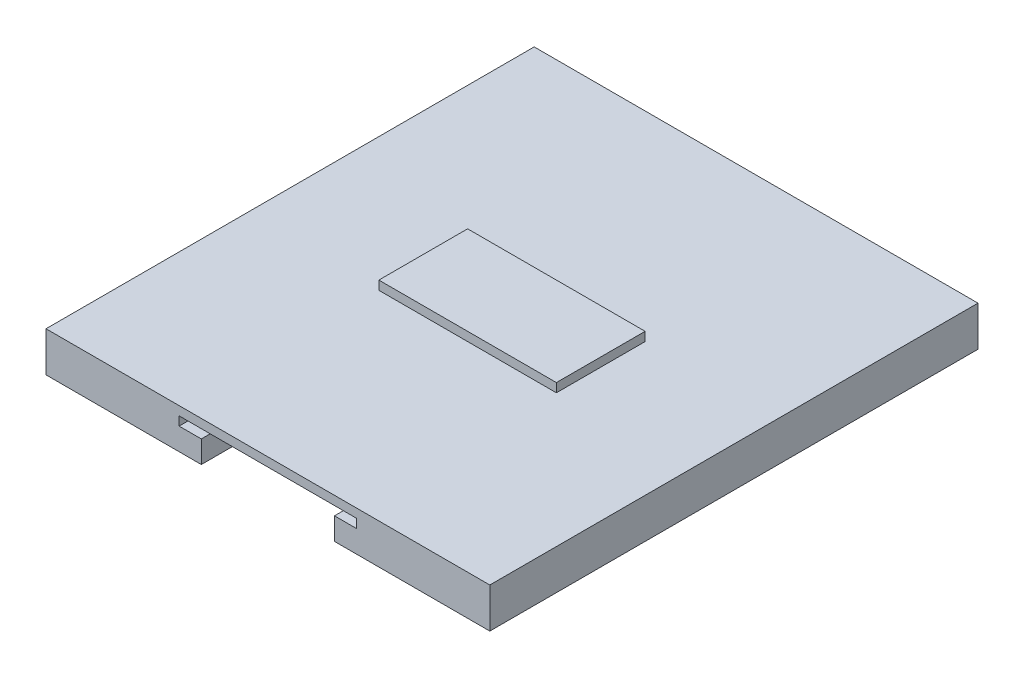
ISO-10303-21;
HEADER;
FILE_DESCRIPTION(('STEP AP214'),'2;1');
FILE_NAME('part.step','',(''),(''),'','','');
FILE_SCHEMA(('AUTOMOTIVE_DESIGN { 1 0 10303 214 1 1 1 1 }'));
ENDSEC;
DATA;
#1=APPLICATION_CONTEXT('core data for automotive mechanical design processes');
#2=APPLICATION_PROTOCOL_DEFINITION('international standard','automotive_design',2000,#1);
#3=PRODUCT_CONTEXT('',#1,'mechanical');
#4=PRODUCT('Part','Part','',(#3));
#5=PRODUCT_RELATED_PRODUCT_CATEGORY('part','',(#4));
#6=PRODUCT_DEFINITION_FORMATION('','',#4);
#7=PRODUCT_DEFINITION_CONTEXT('part definition',#1,'design');
#8=PRODUCT_DEFINITION('design','',#6,#7);
#9=PRODUCT_DEFINITION_SHAPE('','',#8);
#10=(LENGTH_UNIT() NAMED_UNIT(*) SI_UNIT(.MILLI.,.METRE.));
#11=(NAMED_UNIT(*) PLANE_ANGLE_UNIT() SI_UNIT($,.RADIAN.));
#12=(NAMED_UNIT(*) SI_UNIT($,.STERADIAN.) SOLID_ANGLE_UNIT());
#13=UNCERTAINTY_MEASURE_WITH_UNIT(LENGTH_MEASURE(1.E-05),#10,'distance_accuracy_value','');
#14=(GEOMETRIC_REPRESENTATION_CONTEXT(3) GLOBAL_UNCERTAINTY_ASSIGNED_CONTEXT((#13)) GLOBAL_UNIT_ASSIGNED_CONTEXT((#10,
#11,#12)) REPRESENTATION_CONTEXT('',''));
#15=CARTESIAN_POINT('',(0.,0.,0.));
#16=DIRECTION('',(0.,0.,1.));
#17=DIRECTION('',(1.,0.,0.));
#18=AXIS2_PLACEMENT_3D('',#15,#16,#17);
#19=CARTESIAN_POINT('',(-50.,8.99999999999999,55.));
#20=DIRECTION('',(0.,1.,0.));
#21=DIRECTION('',(0.,0.,1.));
#22=AXIS2_PLACEMENT_3D('',#19,#20,#21);
#23=PLANE('',#22);
#24=DIRECTION('',(1.,0.,0.));
#25=VECTOR('',#24,1.);
#26=CARTESIAN_POINT('',(-50.,8.99999999999999,-55.));
#27=LINE('',#26,#25);
#28=CARTESIAN_POINT('',(-50.,8.99999999999999,-55.));
#29=VERTEX_POINT('',#28);
#30=CARTESIAN_POINT('',(50.,8.99999999999999,-55.));
#31=VERTEX_POINT('',#30);
#32=EDGE_CURVE('E259',#29,#31,#27,.T.);
#33=ORIENTED_EDGE('',*,*,#32,.F.);
#34=DIRECTION('',(0.,0.,-1.));
#35=VECTOR('',#34,1.);
#36=CARTESIAN_POINT('',(-50.,8.99999999999999,55.));
#37=LINE('',#36,#35);
#38=CARTESIAN_POINT('',(-50.,8.99999999999999,55.));
#39=VERTEX_POINT('',#38);
#40=EDGE_CURVE('E46',#39,#29,#37,.T.);
#41=ORIENTED_EDGE('',*,*,#40,.F.);
#42=DIRECTION('',(1.,0.,0.));
#43=VECTOR('',#42,1.);
#44=CARTESIAN_POINT('',(-50.,8.99999999999999,55.));
#45=LINE('',#44,#43);
#46=CARTESIAN_POINT('',(50.,8.99999999999999,55.));
#47=VERTEX_POINT('',#46);
#48=EDGE_CURVE('E246',#39,#47,#45,.T.);
#49=ORIENTED_EDGE('',*,*,#48,.T.);
#50=DIRECTION('',(0.,0.,-1.));
#51=VECTOR('',#50,1.);
#52=CARTESIAN_POINT('',(50.,8.99999999999999,55.));
#53=LINE('',#52,#51);
#54=EDGE_CURVE('E268',#47,#31,#53,.T.);
#55=ORIENTED_EDGE('',*,*,#54,.T.);
#56=EDGE_LOOP('',(#33,#41,#49,#55));
#57=FACE_BOUND('',#56,.T.);
#58=DIRECTION('',(1.,0.,0.));
#59=VECTOR('',#58,1.);
#60=CARTESIAN_POINT('',(-20.,8.99999999999999,10.));
#61=LINE('',#60,#59);
#62=CARTESIAN_POINT('',(-20.,8.99999999999999,10.));
#63=VERTEX_POINT('',#62);
#64=CARTESIAN_POINT('',(20.,8.99999999999999,10.));
#65=VERTEX_POINT('',#64);
#66=EDGE_CURVE('E561',#63,#65,#61,.T.);
#67=ORIENTED_EDGE('',*,*,#66,.F.);
#68=DIRECTION('',(0.,0.,1.));
#69=VECTOR('',#68,1.);
#70=CARTESIAN_POINT('',(-20.,8.99999999999999,-10.));
#71=LINE('',#70,#69);
#72=CARTESIAN_POINT('',(-20.,8.99999999999999,-10.));
#73=VERTEX_POINT('',#72);
#74=EDGE_CURVE('E180',#73,#63,#71,.T.);
#75=ORIENTED_EDGE('',*,*,#74,.F.);
#76=DIRECTION('',(-1.,0.,0.));
#77=VECTOR('',#76,1.);
#78=CARTESIAN_POINT('',(-20.,8.99999999999999,-10.));
#79=LINE('',#78,#77);
#80=CARTESIAN_POINT('',(20.,8.99999999999999,-10.));
#81=VERTEX_POINT('',#80);
#82=EDGE_CURVE('E176',#81,#73,#79,.T.);
#83=ORIENTED_EDGE('',*,*,#82,.F.);
#84=DIRECTION('',(0.,0.,-1.));
#85=VECTOR('',#84,1.);
#86=CARTESIAN_POINT('',(20.,8.99999999999999,-10.));
#87=LINE('',#86,#85);
#88=EDGE_CURVE('E558',#65,#81,#87,.T.);
#89=ORIENTED_EDGE('',*,*,#88,.F.);
#90=EDGE_LOOP('',(#67,#75,#83,#89));
#91=FACE_BOUND('',#90,.T.);
#92=ADVANCED_FACE('F42',(#57,#91),#23,.T.);
#93=CARTESIAN_POINT('',(-50.,0.,55.));
#94=DIRECTION('',(0.,-1.,0.));
#95=DIRECTION('',(0.,0.,-1.));
#96=AXIS2_PLACEMENT_3D('',#93,#94,#95);
#97=PLANE('',#96);
#98=DIRECTION('',(0.,0.,-1.));
#99=VECTOR('',#98,1.);
#100=CARTESIAN_POINT('',(-15.,0.,55.));
#101=LINE('',#100,#99);
#102=CARTESIAN_POINT('',(-15.,0.,55.));
#103=VERTEX_POINT('',#102);
#104=CARTESIAN_POINT('',(-15.,0.,-55.));
#105=VERTEX_POINT('',#104);
#106=EDGE_CURVE('E229',#103,#105,#101,.T.);
#107=ORIENTED_EDGE('',*,*,#106,.F.);
#108=DIRECTION('',(-1.,0.,0.));
#109=VECTOR('',#108,1.);
#110=CARTESIAN_POINT('',(-50.,0.,55.));
#111=LINE('',#110,#109);
#112=CARTESIAN_POINT('',(-50.,0.,55.));
#113=VERTEX_POINT('',#112);
#114=EDGE_CURVE('E253',#103,#113,#111,.T.);
#115=ORIENTED_EDGE('',*,*,#114,.T.);
#116=DIRECTION('',(0.,0.,-1.));
#117=VECTOR('',#116,1.);
#118=CARTESIAN_POINT('',(-50.,0.,55.));
#119=LINE('',#118,#117);
#120=CARTESIAN_POINT('',(-50.,0.,-55.));
#121=VERTEX_POINT('',#120);
#122=EDGE_CURVE('E11',#113,#121,#119,.T.);
#123=ORIENTED_EDGE('',*,*,#122,.T.);
#124=DIRECTION('',(-1.,0.,0.));
#125=VECTOR('',#124,1.);
#126=CARTESIAN_POINT('',(-50.,0.,-55.));
#127=LINE('',#126,#125);
#128=EDGE_CURVE('E265',#105,#121,#127,.T.);
#129=ORIENTED_EDGE('',*,*,#128,.F.);
#130=EDGE_LOOP('',(#107,#115,#123,#129));
#131=FACE_BOUND('',#130,.T.);
#132=ADVANCED_FACE('F284',(#131),#97,.T.);
#133=CARTESIAN_POINT('',(-50.,8.99999999999999,55.));
#134=DIRECTION('',(-1.,0.,0.));
#135=DIRECTION('',(0.,0.,1.));
#136=AXIS2_PLACEMENT_3D('',#133,#134,#135);
#137=PLANE('',#136);
#138=DIRECTION('',(0.,1.,0.));
#139=VECTOR('',#138,1.);
#140=CARTESIAN_POINT('',(-50.,8.99999999999999,-55.));
#141=LINE('',#140,#139);
#142=EDGE_CURVE('E228',#121,#29,#141,.T.);
#143=ORIENTED_EDGE('',*,*,#142,.F.);
#144=ORIENTED_EDGE('',*,*,#122,.F.);
#145=DIRECTION('',(0.,1.,0.));
#146=VECTOR('',#145,1.);
#147=CARTESIAN_POINT('',(-50.,8.99999999999999,55.));
#148=LINE('',#147,#146);
#149=EDGE_CURVE('E243',#113,#39,#148,.T.);
#150=ORIENTED_EDGE('',*,*,#149,.T.);
#151=ORIENTED_EDGE('',*,*,#40,.T.);
#152=EDGE_LOOP('',(#143,#144,#150,#151));
#153=FACE_BOUND('',#152,.T.);
#154=ADVANCED_FACE('F44',(#153),#137,.T.);
#155=DIRECTION('',(0.,0.,-1.));
#156=VECTOR('',#155,1.);
#157=CARTESIAN_POINT('',(15.,0.,55.));
#158=LINE('',#157,#156);
#159=CARTESIAN_POINT('',(15.,0.,55.));
#160=VERTEX_POINT('',#159);
#161=CARTESIAN_POINT('',(15.,0.,-55.));
#162=VERTEX_POINT('',#161);
#163=EDGE_CURVE('E231',#160,#162,#158,.T.);
#164=ORIENTED_EDGE('',*,*,#163,.T.);
#165=CARTESIAN_POINT('',(50.,0.,-55.));
#166=VERTEX_POINT('',#165);
#167=EDGE_CURVE('E247',#166,#162,#127,.T.);
#168=ORIENTED_EDGE('',*,*,#167,.F.);
#169=DIRECTION('',(0.,0.,-1.));
#170=VECTOR('',#169,1.);
#171=CARTESIAN_POINT('',(50.,0.,55.));
#172=LINE('',#171,#170);
#173=CARTESIAN_POINT('',(50.,0.,55.));
#174=VERTEX_POINT('',#173);
#175=EDGE_CURVE('E51',#174,#166,#172,.T.);
#176=ORIENTED_EDGE('',*,*,#175,.F.);
#177=EDGE_CURVE('E254',#174,#160,#111,.T.);
#178=ORIENTED_EDGE('',*,*,#177,.T.);
#179=EDGE_LOOP('',(#164,#168,#176,#178));
#180=FACE_BOUND('',#179,.T.);
#181=ADVANCED_FACE('F295',(#180),#97,.T.);
#182=CARTESIAN_POINT('',(50.,8.99999999999999,55.));
#183=DIRECTION('',(1.,0.,0.));
#184=DIRECTION('',(0.,0.,-1.));
#185=AXIS2_PLACEMENT_3D('',#182,#183,#184);
#186=PLANE('',#185);
#187=DIRECTION('',(0.,-1.,0.));
#188=VECTOR('',#187,1.);
#189=CARTESIAN_POINT('',(50.,8.99999999999999,-55.));
#190=LINE('',#189,#188);
#191=EDGE_CURVE('E262',#31,#166,#190,.T.);
#192=ORIENTED_EDGE('',*,*,#191,.F.);
#193=ORIENTED_EDGE('',*,*,#54,.F.);
#194=DIRECTION('',(0.,-1.,0.));
#195=VECTOR('',#194,1.);
#196=CARTESIAN_POINT('',(50.,8.99999999999999,55.));
#197=LINE('',#196,#195);
#198=EDGE_CURVE('E250',#47,#174,#197,.T.);
#199=ORIENTED_EDGE('',*,*,#198,.T.);
#200=ORIENTED_EDGE('',*,*,#175,.T.);
#201=EDGE_LOOP('',(#192,#193,#199,#200));
#202=FACE_BOUND('',#201,.T.);
#203=ADVANCED_FACE('F291',(#202),#186,.T.);
#204=CARTESIAN_POINT('',(-50.,0.,55.));
#205=DIRECTION('',(0.,0.,1.));
#206=DIRECTION('',(1.,0.,0.));
#207=AXIS2_PLACEMENT_3D('',#204,#205,#206);
#208=PLANE('',#207);
#209=DIRECTION('',(0.,1.,0.));
#210=VECTOR('',#209,1.);
#211=CARTESIAN_POINT('',(-15.,0.,55.));
#212=LINE('',#211,#210);
#213=CARTESIAN_POINT('',(-15.,5.,55.));
#214=VERTEX_POINT('',#213);
#215=EDGE_CURVE('E207',#103,#214,#212,.T.);
#216=ORIENTED_EDGE('',*,*,#215,.T.);
#217=DIRECTION('',(-1.,0.,0.));
#218=VECTOR('',#217,1.);
#219=CARTESIAN_POINT('',(-15.,5.,55.));
#220=LINE('',#219,#218);
#221=CARTESIAN_POINT('',(-20.,5.,55.));
#222=VERTEX_POINT('',#221);
#223=EDGE_CURVE('E188',#214,#222,#220,.T.);
#224=ORIENTED_EDGE('',*,*,#223,.T.);
#225=DIRECTION('',(0.,1.,0.));
#226=VECTOR('',#225,1.);
#227=CARTESIAN_POINT('',(-20.,5.,55.));
#228=LINE('',#227,#226);
#229=CARTESIAN_POINT('',(-20.,7.,55.));
#230=VERTEX_POINT('',#229);
#231=EDGE_CURVE('E191',#222,#230,#228,.T.);
#232=ORIENTED_EDGE('',*,*,#231,.T.);
#233=DIRECTION('',(1.,0.,0.));
#234=VECTOR('',#233,1.);
#235=CARTESIAN_POINT('',(-20.,7.,55.));
#236=LINE('',#235,#234);
#237=CARTESIAN_POINT('',(20.,7.,55.));
#238=VERTEX_POINT('',#237);
#239=EDGE_CURVE('E195',#230,#238,#236,.T.);
#240=ORIENTED_EDGE('',*,*,#239,.T.);
#241=DIRECTION('',(0.,-1.,0.));
#242=VECTOR('',#241,1.);
#243=CARTESIAN_POINT('',(20.,7.,55.));
#244=LINE('',#243,#242);
#245=CARTESIAN_POINT('',(20.,5.,55.));
#246=VERTEX_POINT('',#245);
#247=EDGE_CURVE('E198',#238,#246,#244,.T.);
#248=ORIENTED_EDGE('',*,*,#247,.T.);
#249=DIRECTION('',(-1.,0.,0.));
#250=VECTOR('',#249,1.);
#251=CARTESIAN_POINT('',(20.,5.,55.));
#252=LINE('',#251,#250);
#253=CARTESIAN_POINT('',(15.,5.,55.));
#254=VERTEX_POINT('',#253);
#255=EDGE_CURVE('E201',#246,#254,#252,.T.);
#256=ORIENTED_EDGE('',*,*,#255,.T.);
#257=DIRECTION('',(0.,-1.,0.));
#258=VECTOR('',#257,1.);
#259=CARTESIAN_POINT('',(15.,5.,55.));
#260=LINE('',#259,#258);
#261=EDGE_CURVE('E204',#254,#160,#260,.T.);
#262=ORIENTED_EDGE('',*,*,#261,.T.);
#263=ORIENTED_EDGE('',*,*,#177,.F.);
#264=ORIENTED_EDGE('',*,*,#198,.F.);
#265=ORIENTED_EDGE('',*,*,#48,.F.);
#266=ORIENTED_EDGE('',*,*,#149,.F.);
#267=ORIENTED_EDGE('',*,*,#114,.F.);
#268=EDGE_LOOP('',(#216,#224,#232,#240,#248,#256,#262,#263,#264,#265,#266,#267));
#269=FACE_BOUND('',#268,.T.);
#270=ADVANCED_FACE('F287',(#269),#208,.T.);
#271=CARTESIAN_POINT('',(-50.,0.,-55.));
#272=DIRECTION('',(0.,0.,1.));
#273=DIRECTION('',(1.,0.,0.));
#274=AXIS2_PLACEMENT_3D('',#271,#272,#273);
#275=PLANE('',#274);
#276=DIRECTION('',(-1.,0.,0.));
#277=VECTOR('',#276,1.);
#278=CARTESIAN_POINT('',(-15.,5.,-55.));
#279=LINE('',#278,#277);
#280=CARTESIAN_POINT('',(-15.,5.,-55.));
#281=VERTEX_POINT('',#280);
#282=CARTESIAN_POINT('',(-20.,5.,-55.));
#283=VERTEX_POINT('',#282);
#284=EDGE_CURVE('E67',#281,#283,#279,.T.);
#285=ORIENTED_EDGE('',*,*,#284,.F.);
#286=DIRECTION('',(0.,1.,0.));
#287=VECTOR('',#286,1.);
#288=CARTESIAN_POINT('',(-15.,0.,-55.));
#289=LINE('',#288,#287);
#290=EDGE_CURVE('E192',#105,#281,#289,.T.);
#291=ORIENTED_EDGE('',*,*,#290,.F.);
#292=ORIENTED_EDGE('',*,*,#128,.T.);
#293=ORIENTED_EDGE('',*,*,#142,.T.);
#294=ORIENTED_EDGE('',*,*,#32,.T.);
#295=ORIENTED_EDGE('',*,*,#191,.T.);
#296=ORIENTED_EDGE('',*,*,#167,.T.);
#297=DIRECTION('',(0.,-1.,0.));
#298=VECTOR('',#297,1.);
#299=CARTESIAN_POINT('',(15.,5.,-55.));
#300=LINE('',#299,#298);
#301=CARTESIAN_POINT('',(15.,5.,-55.));
#302=VERTEX_POINT('',#301);
#303=EDGE_CURVE('E222',#302,#162,#300,.T.);
#304=ORIENTED_EDGE('',*,*,#303,.F.);
#305=DIRECTION('',(-1.,0.,0.));
#306=VECTOR('',#305,1.);
#307=CARTESIAN_POINT('',(20.,5.,-55.));
#308=LINE('',#307,#306);
#309=CARTESIAN_POINT('',(20.,5.,-55.));
#310=VERTEX_POINT('',#309);
#311=EDGE_CURVE('E219',#310,#302,#308,.T.);
#312=ORIENTED_EDGE('',*,*,#311,.F.);
#313=DIRECTION('',(0.,-1.,0.));
#314=VECTOR('',#313,1.);
#315=CARTESIAN_POINT('',(20.,7.,-55.));
#316=LINE('',#315,#314);
#317=CARTESIAN_POINT('',(20.,7.,-55.));
#318=VERTEX_POINT('',#317);
#319=EDGE_CURVE('E216',#318,#310,#316,.T.);
#320=ORIENTED_EDGE('',*,*,#319,.F.);
#321=DIRECTION('',(1.,0.,0.));
#322=VECTOR('',#321,1.);
#323=CARTESIAN_POINT('',(-20.,7.,-55.));
#324=LINE('',#323,#322);
#325=CARTESIAN_POINT('',(-20.,7.,-55.));
#326=VERTEX_POINT('',#325);
#327=EDGE_CURVE('E213',#326,#318,#324,.T.);
#328=ORIENTED_EDGE('',*,*,#327,.F.);
#329=DIRECTION('',(0.,1.,0.));
#330=VECTOR('',#329,1.);
#331=CARTESIAN_POINT('',(-20.,5.,-55.));
#332=LINE('',#331,#330);
#333=EDGE_CURVE('E183',#283,#326,#332,.T.);
#334=ORIENTED_EDGE('',*,*,#333,.F.);
#335=EDGE_LOOP('',(#285,#291,#292,#293,#294,#295,#296,#304,#312,#320,#328,#334));
#336=FACE_BOUND('',#335,.T.);
#337=ADVANCED_FACE('F279',(#336),#275,.F.);
#338=CARTESIAN_POINT('',(-15.,5.,55.));
#339=DIRECTION('',(0.,-1.,0.));
#340=DIRECTION('',(1.,0.,0.));
#341=AXIS2_PLACEMENT_3D('',#338,#339,#340);
#342=PLANE('',#341);
#343=ORIENTED_EDGE('',*,*,#284,.T.);
#344=DIRECTION('',(0.,0.,-1.));
#345=VECTOR('',#344,1.);
#346=CARTESIAN_POINT('',(-20.,5.,55.));
#347=LINE('',#346,#345);
#348=EDGE_CURVE('E209',#222,#283,#347,.T.);
#349=ORIENTED_EDGE('',*,*,#348,.F.);
#350=ORIENTED_EDGE('',*,*,#223,.F.);
#351=DIRECTION('',(0.,0.,-1.));
#352=VECTOR('',#351,1.);
#353=CARTESIAN_POINT('',(-15.,5.,55.));
#354=LINE('',#353,#352);
#355=EDGE_CURVE('E226',#214,#281,#354,.T.);
#356=ORIENTED_EDGE('',*,*,#355,.T.);
#357=EDGE_LOOP('',(#343,#349,#350,#356));
#358=FACE_BOUND('',#357,.T.);
#359=ADVANCED_FACE('F316',(#358),#342,.F.);
#360=CARTESIAN_POINT('',(-15.,0.,55.));
#361=DIRECTION('',(-1.,0.,0.));
#362=DIRECTION('',(0.,-1.,0.));
#363=AXIS2_PLACEMENT_3D('',#360,#361,#362);
#364=PLANE('',#363);
#365=ORIENTED_EDGE('',*,*,#290,.T.);
#366=ORIENTED_EDGE('',*,*,#355,.F.);
#367=ORIENTED_EDGE('',*,*,#215,.F.);
#368=ORIENTED_EDGE('',*,*,#106,.T.);
#369=EDGE_LOOP('',(#365,#366,#367,#368));
#370=FACE_BOUND('',#369,.T.);
#371=ADVANCED_FACE('F318',(#370),#364,.F.);
#372=CARTESIAN_POINT('',(15.,5.,55.));
#373=DIRECTION('',(1.,0.,0.));
#374=DIRECTION('',(0.,1.,0.));
#375=AXIS2_PLACEMENT_3D('',#372,#373,#374);
#376=PLANE('',#375);
#377=ORIENTED_EDGE('',*,*,#303,.T.);
#378=ORIENTED_EDGE('',*,*,#163,.F.);
#379=ORIENTED_EDGE('',*,*,#261,.F.);
#380=DIRECTION('',(0.,0.,-1.));
#381=VECTOR('',#380,1.);
#382=CARTESIAN_POINT('',(15.,5.,55.));
#383=LINE('',#382,#381);
#384=EDGE_CURVE('E234',#254,#302,#383,.T.);
#385=ORIENTED_EDGE('',*,*,#384,.T.);
#386=EDGE_LOOP('',(#377,#378,#379,#385));
#387=FACE_BOUND('',#386,.T.);
#388=ADVANCED_FACE('F298',(#387),#376,.F.);
#389=CARTESIAN_POINT('',(20.,5.,55.));
#390=DIRECTION('',(0.,-1.,0.));
#391=DIRECTION('',(1.,0.,0.));
#392=AXIS2_PLACEMENT_3D('',#389,#390,#391);
#393=PLANE('',#392);
#394=ORIENTED_EDGE('',*,*,#311,.T.);
#395=ORIENTED_EDGE('',*,*,#384,.F.);
#396=ORIENTED_EDGE('',*,*,#255,.F.);
#397=DIRECTION('',(0.,0.,-1.));
#398=VECTOR('',#397,1.);
#399=CARTESIAN_POINT('',(20.,5.,55.));
#400=LINE('',#399,#398);
#401=EDGE_CURVE('E236',#246,#310,#400,.T.);
#402=ORIENTED_EDGE('',*,*,#401,.T.);
#403=EDGE_LOOP('',(#394,#395,#396,#402));
#404=FACE_BOUND('',#403,.T.);
#405=ADVANCED_FACE('F302',(#404),#393,.F.);
#406=CARTESIAN_POINT('',(20.,7.,55.));
#407=DIRECTION('',(1.,0.,0.));
#408=DIRECTION('',(0.,1.,0.));
#409=AXIS2_PLACEMENT_3D('',#406,#407,#408);
#410=PLANE('',#409);
#411=ORIENTED_EDGE('',*,*,#319,.T.);
#412=ORIENTED_EDGE('',*,*,#401,.F.);
#413=ORIENTED_EDGE('',*,*,#247,.F.);
#414=DIRECTION('',(0.,0.,-1.));
#415=VECTOR('',#414,1.);
#416=CARTESIAN_POINT('',(20.,7.,55.));
#417=LINE('',#416,#415);
#418=EDGE_CURVE('E238',#238,#318,#417,.T.);
#419=ORIENTED_EDGE('',*,*,#418,.T.);
#420=EDGE_LOOP('',(#411,#412,#413,#419));
#421=FACE_BOUND('',#420,.T.);
#422=ADVANCED_FACE('F308',(#421),#410,.F.);
#423=CARTESIAN_POINT('',(-20.,7.,55.));
#424=DIRECTION('',(0.,1.,0.));
#425=DIRECTION('',(0.,0.,1.));
#426=AXIS2_PLACEMENT_3D('',#423,#424,#425);
#427=PLANE('',#426);
#428=ORIENTED_EDGE('',*,*,#327,.T.);
#429=ORIENTED_EDGE('',*,*,#418,.F.);
#430=ORIENTED_EDGE('',*,*,#239,.F.);
#431=DIRECTION('',(0.,0.,-1.));
#432=VECTOR('',#431,1.);
#433=CARTESIAN_POINT('',(-20.,7.,55.));
#434=LINE('',#433,#432);
#435=EDGE_CURVE('E240',#230,#326,#434,.T.);
#436=ORIENTED_EDGE('',*,*,#435,.T.);
#437=EDGE_LOOP('',(#428,#429,#430,#436));
#438=FACE_BOUND('',#437,.T.);
#439=ADVANCED_FACE('F311',(#438),#427,.F.);
#440=CARTESIAN_POINT('',(-20.,5.,55.));
#441=DIRECTION('',(-1.,0.,0.));
#442=DIRECTION('',(0.,0.,1.));
#443=AXIS2_PLACEMENT_3D('',#440,#441,#442);
#444=PLANE('',#443);
#445=ORIENTED_EDGE('',*,*,#333,.T.);
#446=ORIENTED_EDGE('',*,*,#435,.F.);
#447=ORIENTED_EDGE('',*,*,#231,.F.);
#448=ORIENTED_EDGE('',*,*,#348,.T.);
#449=EDGE_LOOP('',(#445,#446,#447,#448));
#450=FACE_BOUND('',#449,.T.);
#451=ADVANCED_FACE('F314',(#450),#444,.F.);
#452=CARTESIAN_POINT('',(-20.,11.,-10.));
#453=DIRECTION('',(1.,0.,0.));
#454=DIRECTION('',(0.,0.,-1.));
#455=AXIS2_PLACEMENT_3D('',#452,#453,#454);
#456=PLANE('',#455);
#457=ORIENTED_EDGE('',*,*,#74,.T.);
#458=DIRECTION('',(0.,-1.,0.));
#459=VECTOR('',#458,1.);
#460=CARTESIAN_POINT('',(-20.,11.,10.));
#461=LINE('',#460,#459);
#462=CARTESIAN_POINT('',(-20.,11.,10.));
#463=VERTEX_POINT('',#462);
#464=EDGE_CURVE('E161',#463,#63,#461,.T.);
#465=ORIENTED_EDGE('',*,*,#464,.F.);
#466=DIRECTION('',(0.,0.,1.));
#467=VECTOR('',#466,1.);
#468=CARTESIAN_POINT('',(-20.,11.,-10.));
#469=LINE('',#468,#467);
#470=CARTESIAN_POINT('',(-20.,11.,-10.));
#471=VERTEX_POINT('',#470);
#472=EDGE_CURVE('E168',#471,#463,#469,.T.);
#473=ORIENTED_EDGE('',*,*,#472,.F.);
#474=DIRECTION('',(0.,-1.,0.));
#475=VECTOR('',#474,1.);
#476=CARTESIAN_POINT('',(-20.,11.,-10.));
#477=LINE('',#476,#475);
#478=EDGE_CURVE('E556',#471,#73,#477,.T.);
#479=ORIENTED_EDGE('',*,*,#478,.T.);
#480=EDGE_LOOP('',(#457,#465,#473,#479));
#481=FACE_BOUND('',#480,.T.);
#482=ADVANCED_FACE('F178',(#481),#456,.F.);
#483=CARTESIAN_POINT('',(-20.,11.,10.));
#484=DIRECTION('',(0.,0.,-1.));
#485=DIRECTION('',(-1.,0.,0.));
#486=AXIS2_PLACEMENT_3D('',#483,#484,#485);
#487=PLANE('',#486);
#488=ORIENTED_EDGE('',*,*,#66,.T.);
#489=DIRECTION('',(0.,-1.,0.));
#490=VECTOR('',#489,1.);
#491=CARTESIAN_POINT('',(20.,11.,10.));
#492=LINE('',#491,#490);
#493=CARTESIAN_POINT('',(20.,11.,10.));
#494=VERTEX_POINT('',#493);
#495=EDGE_CURVE('E164',#494,#65,#492,.T.);
#496=ORIENTED_EDGE('',*,*,#495,.F.);
#497=DIRECTION('',(1.,0.,0.));
#498=VECTOR('',#497,1.);
#499=CARTESIAN_POINT('',(-20.,11.,10.));
#500=LINE('',#499,#498);
#501=EDGE_CURVE('E157',#463,#494,#500,.T.);
#502=ORIENTED_EDGE('',*,*,#501,.F.);
#503=ORIENTED_EDGE('',*,*,#464,.T.);
#504=EDGE_LOOP('',(#488,#496,#502,#503));
#505=FACE_BOUND('',#504,.T.);
#506=ADVANCED_FACE('F159',(#505),#487,.F.);
#507=CARTESIAN_POINT('',(20.,11.,-10.));
#508=DIRECTION('',(-1.,0.,0.));
#509=DIRECTION('',(0.,0.,1.));
#510=AXIS2_PLACEMENT_3D('',#507,#508,#509);
#511=PLANE('',#510);
#512=ORIENTED_EDGE('',*,*,#88,.T.);
#513=DIRECTION('',(0.,-1.,0.));
#514=VECTOR('',#513,1.);
#515=CARTESIAN_POINT('',(20.,11.,-10.));
#516=LINE('',#515,#514);
#517=CARTESIAN_POINT('',(20.,11.,-10.));
#518=VERTEX_POINT('',#517);
#519=EDGE_CURVE('E59',#518,#81,#516,.T.);
#520=ORIENTED_EDGE('',*,*,#519,.F.);
#521=DIRECTION('',(0.,0.,-1.));
#522=VECTOR('',#521,1.);
#523=CARTESIAN_POINT('',(20.,11.,-10.));
#524=LINE('',#523,#522);
#525=EDGE_CURVE('E167',#494,#518,#524,.T.);
#526=ORIENTED_EDGE('',*,*,#525,.F.);
#527=ORIENTED_EDGE('',*,*,#495,.T.);
#528=EDGE_LOOP('',(#512,#520,#526,#527));
#529=FACE_BOUND('',#528,.T.);
#530=ADVANCED_FACE('F375',(#529),#511,.F.);
#531=CARTESIAN_POINT('',(-20.,11.,-10.));
#532=DIRECTION('',(0.,0.,1.));
#533=DIRECTION('',(1.,0.,0.));
#534=AXIS2_PLACEMENT_3D('',#531,#532,#533);
#535=PLANE('',#534);
#536=ORIENTED_EDGE('',*,*,#82,.T.);
#537=ORIENTED_EDGE('',*,*,#478,.F.);
#538=DIRECTION('',(-1.,0.,0.));
#539=VECTOR('',#538,1.);
#540=CARTESIAN_POINT('',(-20.,11.,-10.));
#541=LINE('',#540,#539);
#542=EDGE_CURVE('E172',#518,#471,#541,.T.);
#543=ORIENTED_EDGE('',*,*,#542,.F.);
#544=ORIENTED_EDGE('',*,*,#519,.T.);
#545=EDGE_LOOP('',(#536,#537,#543,#544));
#546=FACE_BOUND('',#545,.T.);
#547=ADVANCED_FACE('F382',(#546),#535,.F.);
#548=CARTESIAN_POINT('',(-20.,11.,10.));
#549=DIRECTION('',(0.,1.,0.));
#550=DIRECTION('',(0.,0.,1.));
#551=AXIS2_PLACEMENT_3D('',#548,#549,#550);
#552=PLANE('',#551);
#553=ORIENTED_EDGE('',*,*,#472,.T.);
#554=ORIENTED_EDGE('',*,*,#501,.T.);
#555=ORIENTED_EDGE('',*,*,#525,.T.);
#556=ORIENTED_EDGE('',*,*,#542,.T.);
#557=EDGE_LOOP('',(#553,#554,#555,#556));
#558=FACE_BOUND('',#557,.T.);
#559=ADVANCED_FACE('F171',(#558),#552,.T.);
#560=CLOSED_SHELL('',(#92,#132,#154,#181,#203,#270,#337,#359,#371,#388,#405,#422,#439,#451,#482,
#506,#530,#547,#559));
#561=MANIFOLD_SOLID_BREP('B2',#560);
#562=ADVANCED_BREP_SHAPE_REPRESENTATION('',(#18,#561),#14);
#563=SHAPE_DEFINITION_REPRESENTATION(#9,#562);
ENDSEC;
END-ISO-10303-21;
